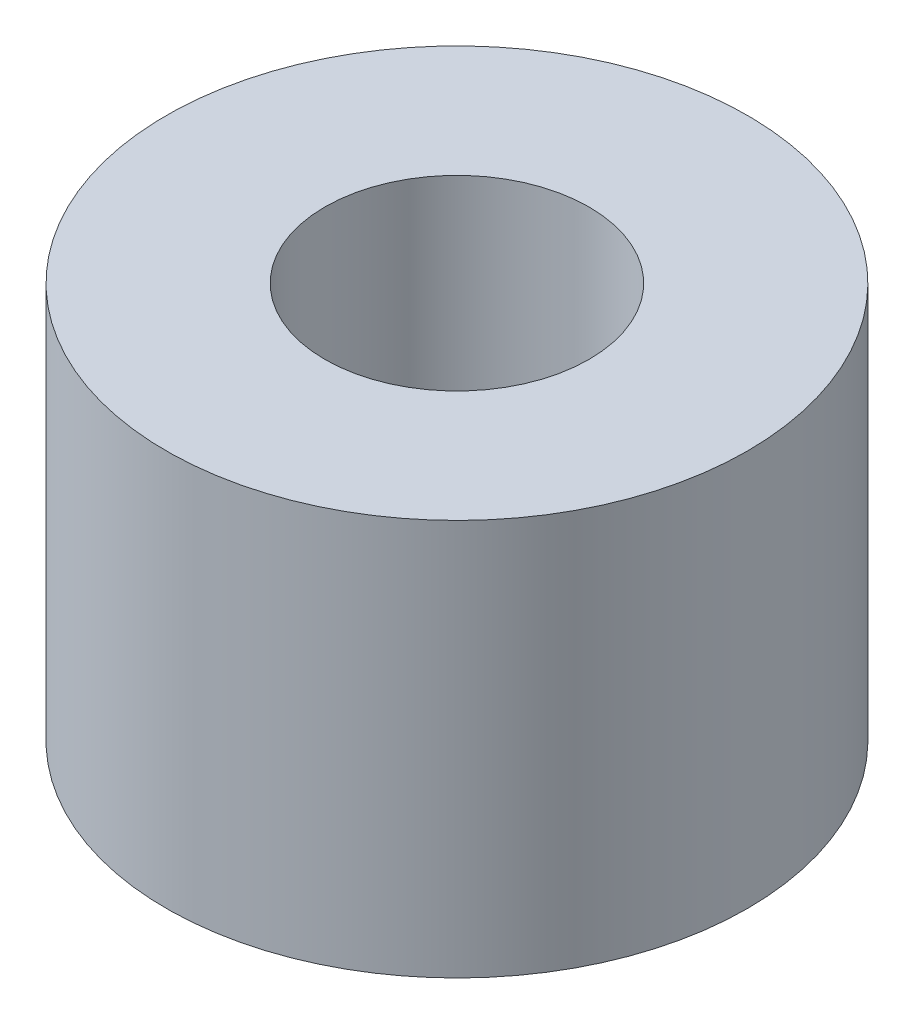
ISO-10303-21;
HEADER;
FILE_DESCRIPTION(('STEP AP214'),'2;1');
FILE_NAME('part.step','',(''),(''),'','','');
FILE_SCHEMA(('AUTOMOTIVE_DESIGN { 1 0 10303 214 1 1 1 1 }'));
ENDSEC;
DATA;
#1=APPLICATION_CONTEXT('core data for automotive mechanical design processes');
#2=APPLICATION_PROTOCOL_DEFINITION('international standard','automotive_design',2000,#1);
#3=PRODUCT_CONTEXT('',#1,'mechanical');
#4=PRODUCT('Part','Part','',(#3));
#5=PRODUCT_RELATED_PRODUCT_CATEGORY('part','',(#4));
#6=PRODUCT_DEFINITION_FORMATION('','',#4);
#7=PRODUCT_DEFINITION_CONTEXT('part definition',#1,'design');
#8=PRODUCT_DEFINITION('design','',#6,#7);
#9=PRODUCT_DEFINITION_SHAPE('','',#8);
#10=(LENGTH_UNIT() NAMED_UNIT(*) SI_UNIT(.MILLI.,.METRE.));
#11=(NAMED_UNIT(*) PLANE_ANGLE_UNIT() SI_UNIT($,.RADIAN.));
#12=(NAMED_UNIT(*) SI_UNIT($,.STERADIAN.) SOLID_ANGLE_UNIT());
#13=UNCERTAINTY_MEASURE_WITH_UNIT(LENGTH_MEASURE(1.E-05),#10,'distance_accuracy_value','');
#14=(GEOMETRIC_REPRESENTATION_CONTEXT(3) GLOBAL_UNCERTAINTY_ASSIGNED_CONTEXT((#13)) GLOBAL_UNIT_ASSIGNED_CONTEXT((#10,
#11,#12)) REPRESENTATION_CONTEXT('',''));
#15=CARTESIAN_POINT('',(0.,0.,0.));
#16=DIRECTION('',(0.,0.,1.));
#17=DIRECTION('',(1.,0.,0.));
#18=AXIS2_PLACEMENT_3D('',#15,#16,#17);
#19=CARTESIAN_POINT('',(0.,-1.5,0.));
#20=DIRECTION('',(0.,-1.,0.));
#21=DIRECTION('',(1.,0.,0.));
#22=AXIS2_PLACEMENT_3D('',#19,#20,#21);
#23=CYLINDRICAL_SURFACE('',#22,2.2);
#24=CARTESIAN_POINT('',(0.,-1.5,0.));
#25=DIRECTION('',(0.,-1.,0.));
#26=DIRECTION('',(1.,0.,0.));
#27=AXIS2_PLACEMENT_3D('',#24,#25,#26);
#28=CIRCLE('',#27,2.2);
#29=CARTESIAN_POINT('',(2.2,-1.5,0.));
#30=VERTEX_POINT('',#29);
#31=EDGE_CURVE('E12',#30,#30,#28,.T.);
#32=ORIENTED_EDGE('',*,*,#31,.F.);
#33=EDGE_LOOP('',(#32));
#34=FACE_BOUND('',#33,.T.);
#35=CARTESIAN_POINT('',(0.,1.5,0.));
#36=DIRECTION('',(0.,-1.,0.));
#37=DIRECTION('',(1.,0.,0.));
#38=AXIS2_PLACEMENT_3D('',#35,#36,#37);
#39=CIRCLE('',#38,2.2);
#40=CARTESIAN_POINT('',(2.20000000000001,1.5,0.));
#41=VERTEX_POINT('',#40);
#42=EDGE_CURVE('E52',#41,#41,#39,.T.);
#43=ORIENTED_EDGE('',*,*,#42,.T.);
#44=EDGE_LOOP('',(#43));
#45=FACE_BOUND('',#44,.T.);
#46=ADVANCED_FACE('F46',(#34,#45),#23,.T.);
#47=CARTESIAN_POINT('',(-2.2,-1.50000000000015,0.));
#48=DIRECTION('',(0.,1.,0.));
#49=DIRECTION('',(-1.,0.,0.));
#50=AXIS2_PLACEMENT_3D('',#47,#48,#49);
#51=PLANE('',#50);
#52=CARTESIAN_POINT('',(0.,-1.5,0.));
#53=DIRECTION('',(0.,1.,0.));
#54=DIRECTION('',(-1.,0.,0.));
#55=AXIS2_PLACEMENT_3D('',#52,#53,#54);
#56=CIRCLE('',#55,1.);
#57=CARTESIAN_POINT('',(-0.999999999999988,-1.5,0.));
#58=VERTEX_POINT('',#57);
#59=EDGE_CURVE('E56',#58,#58,#56,.F.);
#60=ORIENTED_EDGE('',*,*,#59,.F.);
#61=EDGE_LOOP('',(#60));
#62=FACE_BOUND('',#61,.T.);
#63=ORIENTED_EDGE('',*,*,#31,.T.);
#64=EDGE_LOOP('',(#63));
#65=FACE_BOUND('',#64,.T.);
#66=ADVANCED_FACE('F71',(#62,#65),#51,.F.);
#67=CARTESIAN_POINT('',(-2.2,1.49999999999984,0.));
#68=DIRECTION('',(0.,-1.,0.));
#69=DIRECTION('',(1.,0.,0.));
#70=AXIS2_PLACEMENT_3D('',#67,#68,#69);
#71=PLANE('',#70);
#72=CARTESIAN_POINT('',(0.,1.5,0.));
#73=DIRECTION('',(0.,1.,0.));
#74=DIRECTION('',(-1.,0.,0.));
#75=AXIS2_PLACEMENT_3D('',#72,#73,#74);
#76=CIRCLE('',#75,1.);
#77=CARTESIAN_POINT('',(-1.,1.5,0.));
#78=VERTEX_POINT('',#77);
#79=EDGE_CURVE('E60',#78,#78,#76,.T.);
#80=ORIENTED_EDGE('',*,*,#79,.F.);
#81=EDGE_LOOP('',(#80));
#82=FACE_BOUND('',#81,.T.);
#83=ORIENTED_EDGE('',*,*,#42,.F.);
#84=EDGE_LOOP('',(#83));
#85=FACE_BOUND('',#84,.T.);
#86=ADVANCED_FACE('F68',(#82,#85),#71,.F.);
#87=CARTESIAN_POINT('',(0.,-4.32842712474619,0.));
#88=DIRECTION('',(0.,1.,0.));
#89=DIRECTION('',(-1.,0.,0.));
#90=AXIS2_PLACEMENT_3D('',#87,#88,#89);
#91=CYLINDRICAL_SURFACE('',#90,1.);
#92=ORIENTED_EDGE('',*,*,#59,.T.);
#93=EDGE_LOOP('',(#92));
#94=FACE_BOUND('',#93,.T.);
#95=ORIENTED_EDGE('',*,*,#79,.T.);
#96=EDGE_LOOP('',(#95));
#97=FACE_BOUND('',#96,.T.);
#98=ADVANCED_FACE('F66',(#94,#97),#91,.F.);
#99=CLOSED_SHELL('',(#46,#66,#86,#98));
#100=MANIFOLD_SOLID_BREP('B2',#99);
#101=ADVANCED_BREP_SHAPE_REPRESENTATION('',(#18,#100),#14);
#102=SHAPE_DEFINITION_REPRESENTATION(#9,#101);
ENDSEC;
END-ISO-10303-21;
